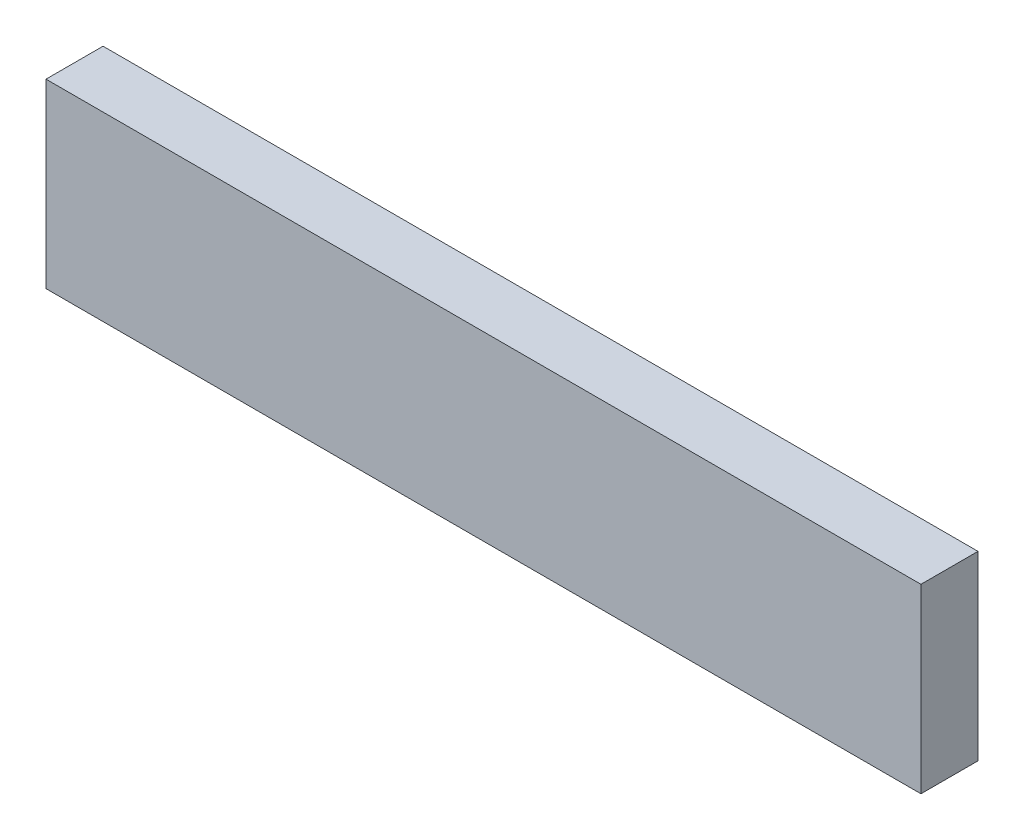
ISO-10303-21;
HEADER;
FILE_DESCRIPTION(('STEP AP214'),'2;1');
FILE_NAME('part.step','',(''),(''),'','','');
FILE_SCHEMA(('AUTOMOTIVE_DESIGN { 1 0 10303 214 1 1 1 1 }'));
ENDSEC;
DATA;
#1=APPLICATION_CONTEXT('core data for automotive mechanical design processes');
#2=APPLICATION_PROTOCOL_DEFINITION('international standard','automotive_design',2000,#1);
#3=PRODUCT_CONTEXT('',#1,'mechanical');
#4=PRODUCT('Part','Part','',(#3));
#5=PRODUCT_RELATED_PRODUCT_CATEGORY('part','',(#4));
#6=PRODUCT_DEFINITION_FORMATION('','',#4);
#7=PRODUCT_DEFINITION_CONTEXT('part definition',#1,'design');
#8=PRODUCT_DEFINITION('design','',#6,#7);
#9=PRODUCT_DEFINITION_SHAPE('','',#8);
#10=(LENGTH_UNIT() NAMED_UNIT(*) SI_UNIT(.MILLI.,.METRE.));
#11=(NAMED_UNIT(*) PLANE_ANGLE_UNIT() SI_UNIT($,.RADIAN.));
#12=(NAMED_UNIT(*) SI_UNIT($,.STERADIAN.) SOLID_ANGLE_UNIT());
#13=UNCERTAINTY_MEASURE_WITH_UNIT(LENGTH_MEASURE(1.E-05),#10,'distance_accuracy_value','');
#14=(GEOMETRIC_REPRESENTATION_CONTEXT(3) GLOBAL_UNCERTAINTY_ASSIGNED_CONTEXT((#13)) GLOBAL_UNIT_ASSIGNED_CONTEXT((#10,
#11,#12)) REPRESENTATION_CONTEXT('',''));
#15=CARTESIAN_POINT('',(0.,0.,0.));
#16=DIRECTION('',(0.,0.,1.));
#17=DIRECTION('',(1.,0.,0.));
#18=AXIS2_PLACEMENT_3D('',#15,#16,#17);
#19=CARTESIAN_POINT('',(73.0250000000003,15.143785054,9.525));
#20=DIRECTION('',(-1.,0.,0.));
#21=DIRECTION('',(0.,0.,1.));
#22=AXIS2_PLACEMENT_3D('',#19,#20,#21);
#23=PLANE('',#22);
#24=DIRECTION('',(0.,1.,0.));
#25=VECTOR('',#24,1.);
#26=CARTESIAN_POINT('',(73.0250000000003,15.143785054,0.));
#27=LINE('',#26,#25);
#28=CARTESIAN_POINT('',(73.0250000000003,-15.143785054,0.));
#29=VERTEX_POINT('',#28);
#30=CARTESIAN_POINT('',(73.0250000000003,15.143785054,0.));
#31=VERTEX_POINT('',#30);
#32=EDGE_CURVE('E101',#29,#31,#27,.T.);
#33=ORIENTED_EDGE('',*,*,#32,.T.);
#34=DIRECTION('',(0.,0.,-1.));
#35=VECTOR('',#34,1.);
#36=CARTESIAN_POINT('',(73.0250000000003,15.143785054,9.525));
#37=LINE('',#36,#35);
#38=CARTESIAN_POINT('',(73.0250000000003,15.143785054,9.525));
#39=VERTEX_POINT('',#38);
#40=EDGE_CURVE('E11',#39,#31,#37,.T.);
#41=ORIENTED_EDGE('',*,*,#40,.F.);
#42=DIRECTION('',(0.,1.,0.));
#43=VECTOR('',#42,1.);
#44=CARTESIAN_POINT('',(73.0250000000003,15.143785054,9.525));
#45=LINE('',#44,#43);
#46=CARTESIAN_POINT('',(73.0250000000003,-15.143785054,9.525));
#47=VERTEX_POINT('',#46);
#48=EDGE_CURVE('E89',#47,#39,#45,.T.);
#49=ORIENTED_EDGE('',*,*,#48,.F.);
#50=DIRECTION('',(0.,0.,-1.));
#51=VECTOR('',#50,1.);
#52=CARTESIAN_POINT('',(73.0250000000003,-15.143785054,9.525));
#53=LINE('',#52,#51);
#54=EDGE_CURVE('E97',#47,#29,#53,.T.);
#55=ORIENTED_EDGE('',*,*,#54,.T.);
#56=EDGE_LOOP('',(#33,#41,#49,#55));
#57=FACE_BOUND('',#56,.T.);
#58=ADVANCED_FACE('F38',(#57),#23,.F.);
#59=CARTESIAN_POINT('',(-73.0249999999997,15.143785054,9.525));
#60=DIRECTION('',(0.,-1.,0.));
#61=DIRECTION('',(0.,0.,-1.));
#62=AXIS2_PLACEMENT_3D('',#59,#60,#61);
#63=PLANE('',#62);
#64=DIRECTION('',(-1.,0.,0.));
#65=VECTOR('',#64,1.);
#66=CARTESIAN_POINT('',(-73.0249999999997,15.143785054,0.));
#67=LINE('',#66,#65);
#68=CARTESIAN_POINT('',(-73.0249999999997,15.143785054,0.));
#69=VERTEX_POINT('',#68);
#70=EDGE_CURVE('E93',#31,#69,#67,.T.);
#71=ORIENTED_EDGE('',*,*,#70,.T.);
#72=DIRECTION('',(0.,0.,-1.));
#73=VECTOR('',#72,1.);
#74=CARTESIAN_POINT('',(-73.0249999999997,15.143785054,9.525));
#75=LINE('',#74,#73);
#76=CARTESIAN_POINT('',(-73.0249999999997,15.143785054,9.525));
#77=VERTEX_POINT('',#76);
#78=EDGE_CURVE('E46',#77,#69,#75,.T.);
#79=ORIENTED_EDGE('',*,*,#78,.F.);
#80=DIRECTION('',(-1.,0.,0.));
#81=VECTOR('',#80,1.);
#82=CARTESIAN_POINT('',(-73.0249999999997,15.143785054,9.525));
#83=LINE('',#82,#81);
#84=EDGE_CURVE('E84',#39,#77,#83,.T.);
#85=ORIENTED_EDGE('',*,*,#84,.F.);
#86=ORIENTED_EDGE('',*,*,#40,.T.);
#87=EDGE_LOOP('',(#71,#79,#85,#86));
#88=FACE_BOUND('',#87,.T.);
#89=ADVANCED_FACE('F92',(#88),#63,.F.);
#90=CARTESIAN_POINT('',(-73.0249999999997,15.143785054,9.525));
#91=DIRECTION('',(1.,0.,0.));
#92=DIRECTION('',(0.,0.,-1.));
#93=AXIS2_PLACEMENT_3D('',#90,#91,#92);
#94=PLANE('',#93);
#95=DIRECTION('',(0.,-1.,0.));
#96=VECTOR('',#95,1.);
#97=CARTESIAN_POINT('',(-73.0249999999997,15.143785054,0.));
#98=LINE('',#97,#96);
#99=CARTESIAN_POINT('',(-73.0249999999997,-15.143785054,0.));
#100=VERTEX_POINT('',#99);
#101=EDGE_CURVE('E71',#69,#100,#98,.T.);
#102=ORIENTED_EDGE('',*,*,#101,.T.);
#103=DIRECTION('',(0.,0.,-1.));
#104=VECTOR('',#103,1.);
#105=CARTESIAN_POINT('',(-73.0249999999997,-15.143785054,9.525));
#106=LINE('',#105,#104);
#107=CARTESIAN_POINT('',(-73.0249999999997,-15.143785054,9.525));
#108=VERTEX_POINT('',#107);
#109=EDGE_CURVE('E94',#108,#100,#106,.T.);
#110=ORIENTED_EDGE('',*,*,#109,.F.);
#111=DIRECTION('',(0.,-1.,0.));
#112=VECTOR('',#111,1.);
#113=CARTESIAN_POINT('',(-73.0249999999997,15.143785054,9.525));
#114=LINE('',#113,#112);
#115=EDGE_CURVE('E87',#77,#108,#114,.T.);
#116=ORIENTED_EDGE('',*,*,#115,.F.);
#117=ORIENTED_EDGE('',*,*,#78,.T.);
#118=EDGE_LOOP('',(#102,#110,#116,#117));
#119=FACE_BOUND('',#118,.T.);
#120=ADVANCED_FACE('F95',(#119),#94,.F.);
#121=CARTESIAN_POINT('',(-73.0249999999997,-15.143785054,9.525));
#122=DIRECTION('',(0.,1.,0.));
#123=DIRECTION('',(0.,0.,1.));
#124=AXIS2_PLACEMENT_3D('',#121,#122,#123);
#125=PLANE('',#124);
#126=DIRECTION('',(1.,0.,0.));
#127=VECTOR('',#126,1.);
#128=CARTESIAN_POINT('',(-73.0249999999997,-15.143785054,0.));
#129=LINE('',#128,#127);
#130=EDGE_CURVE('E77',#100,#29,#129,.T.);
#131=ORIENTED_EDGE('',*,*,#130,.T.);
#132=ORIENTED_EDGE('',*,*,#54,.F.);
#133=DIRECTION('',(1.,0.,0.));
#134=VECTOR('',#133,1.);
#135=CARTESIAN_POINT('',(-73.0249999999997,-15.143785054,9.525));
#136=LINE('',#135,#134);
#137=EDGE_CURVE('E54',#108,#47,#136,.T.);
#138=ORIENTED_EDGE('',*,*,#137,.F.);
#139=ORIENTED_EDGE('',*,*,#109,.T.);
#140=EDGE_LOOP('',(#131,#132,#138,#139));
#141=FACE_BOUND('',#140,.T.);
#142=ADVANCED_FACE('F108',(#141),#125,.F.);
#143=CARTESIAN_POINT('',(0.,0.,9.525));
#144=DIRECTION('',(0.,0.,1.));
#145=DIRECTION('',(1.,0.,0.));
#146=AXIS2_PLACEMENT_3D('',#143,#144,#145);
#147=PLANE('',#146);
#148=ORIENTED_EDGE('',*,*,#48,.T.);
#149=ORIENTED_EDGE('',*,*,#84,.T.);
#150=ORIENTED_EDGE('',*,*,#115,.T.);
#151=ORIENTED_EDGE('',*,*,#137,.T.);
#152=EDGE_LOOP('',(#148,#149,#150,#151));
#153=FACE_BOUND('',#152,.T.);
#154=ADVANCED_FACE('F85',(#153),#147,.T.);
#155=CARTESIAN_POINT('',(0.,0.,0.));
#156=DIRECTION('',(0.,0.,1.));
#157=DIRECTION('',(1.,0.,0.));
#158=AXIS2_PLACEMENT_3D('',#155,#156,#157);
#159=PLANE('',#158);
#160=ORIENTED_EDGE('',*,*,#32,.F.);
#161=ORIENTED_EDGE('',*,*,#130,.F.);
#162=ORIENTED_EDGE('',*,*,#101,.F.);
#163=ORIENTED_EDGE('',*,*,#70,.F.);
#164=EDGE_LOOP('',(#160,#161,#162,#163));
#165=FACE_BOUND('',#164,.T.);
#166=ADVANCED_FACE('F111',(#165),#159,.F.);
#167=CLOSED_SHELL('',(#58,#89,#120,#142,#154,#166));
#168=MANIFOLD_SOLID_BREP('B2',#167);
#169=ADVANCED_BREP_SHAPE_REPRESENTATION('',(#18,#168),#14);
#170=SHAPE_DEFINITION_REPRESENTATION(#9,#169);
ENDSEC;
END-ISO-10303-21;
